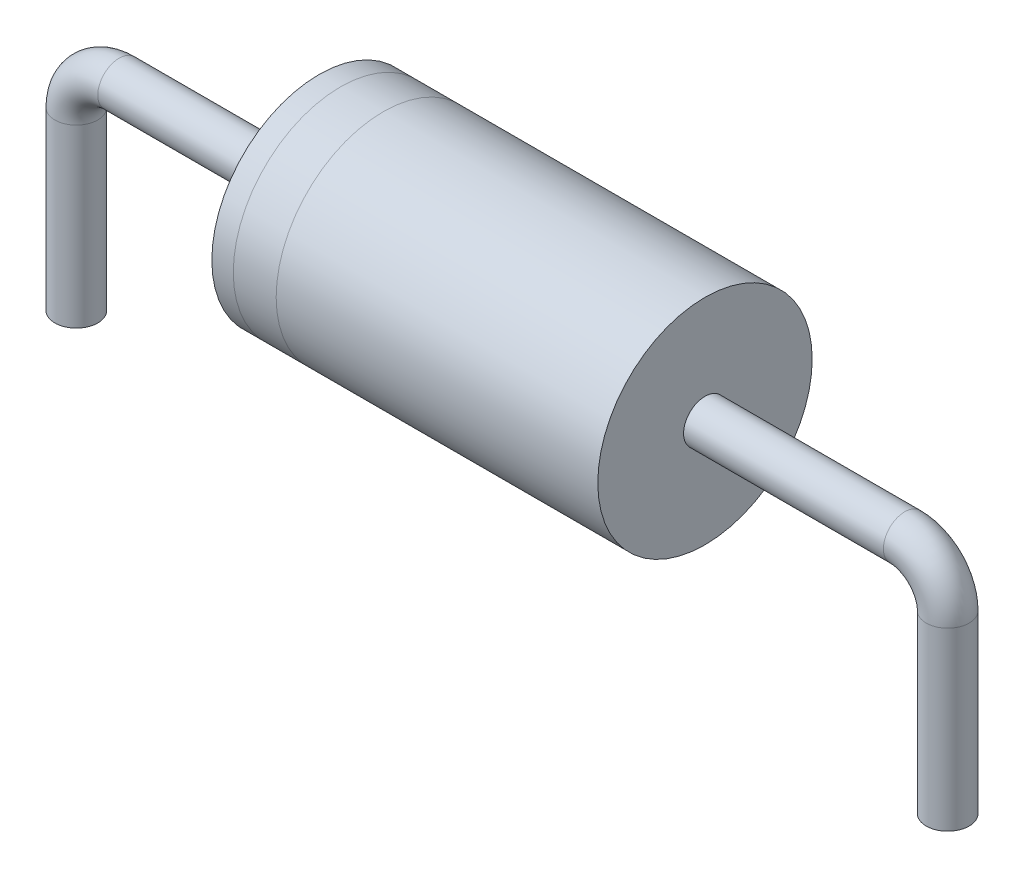
ISO-10303-21;
HEADER;
FILE_DESCRIPTION(('STEP AP214'),'2;1');
FILE_NAME('part.step','',(''),(''),'','','');
FILE_SCHEMA(('AUTOMOTIVE_DESIGN { 1 0 10303 214 1 1 1 1 }'));
ENDSEC;
DATA;
#1=APPLICATION_CONTEXT('core data for automotive mechanical design processes');
#2=APPLICATION_PROTOCOL_DEFINITION('international standard','automotive_design',2000,#1);
#3=PRODUCT_CONTEXT('',#1,'mechanical');
#4=PRODUCT('Part','Part','',(#3));
#5=PRODUCT_RELATED_PRODUCT_CATEGORY('part','',(#4));
#6=PRODUCT_DEFINITION_FORMATION('','',#4);
#7=PRODUCT_DEFINITION_CONTEXT('part definition',#1,'design');
#8=PRODUCT_DEFINITION('design','',#6,#7);
#9=PRODUCT_DEFINITION_SHAPE('','',#8);
#10=(LENGTH_UNIT() NAMED_UNIT(*) SI_UNIT(.MILLI.,.METRE.));
#11=(NAMED_UNIT(*) PLANE_ANGLE_UNIT() SI_UNIT($,.RADIAN.));
#12=(NAMED_UNIT(*) SI_UNIT($,.STERADIAN.) SOLID_ANGLE_UNIT());
#13=UNCERTAINTY_MEASURE_WITH_UNIT(LENGTH_MEASURE(1.E-05),#10,'distance_accuracy_value','');
#14=(GEOMETRIC_REPRESENTATION_CONTEXT(3) GLOBAL_UNCERTAINTY_ASSIGNED_CONTEXT((#13)) GLOBAL_UNIT_ASSIGNED_CONTEXT((#10,
#11,#12)) REPRESENTATION_CONTEXT('',''));
#15=CARTESIAN_POINT('',(0.,0.,0.));
#16=DIRECTION('',(0.,0.,1.));
#17=DIRECTION('',(1.,0.,0.));
#18=AXIS2_PLACEMENT_3D('',#15,#16,#17);
#19=CARTESIAN_POINT('',(-4.5,0.,0.));
#20=DIRECTION('',(1.,0.,0.));
#21=DIRECTION('',(0.,0.,-1.));
#22=AXIS2_PLACEMENT_3D('',#19,#20,#21);
#23=CYLINDRICAL_SURFACE('',#22,2.5);
#24=CARTESIAN_POINT('',(-3.,0.,0.));
#25=DIRECTION('',(1.,0.,0.));
#26=DIRECTION('',(0.,0.,-1.));
#27=AXIS2_PLACEMENT_3D('',#24,#25,#26);
#28=CIRCLE('',#27,2.5);
#29=CARTESIAN_POINT('',(-3.,0.,-2.5));
#30=VERTEX_POINT('',#29);
#31=EDGE_CURVE('E76',#30,#30,#28,.T.);
#32=ORIENTED_EDGE('',*,*,#31,.F.);
#33=EDGE_LOOP('',(#32));
#34=FACE_BOUND('',#33,.T.);
#35=CARTESIAN_POINT('',(-4.,0.,0.));
#36=DIRECTION('',(1.,0.,0.));
#37=DIRECTION('',(0.,0.,-1.));
#38=AXIS2_PLACEMENT_3D('',#35,#36,#37);
#39=CIRCLE('',#38,2.5);
#40=CARTESIAN_POINT('',(-4.,0.,-2.5));
#41=VERTEX_POINT('',#40);
#42=EDGE_CURVE('E13',#41,#41,#39,.T.);
#43=ORIENTED_EDGE('',*,*,#42,.T.);
#44=EDGE_LOOP('',(#43));
#45=FACE_BOUND('',#44,.T.);
#46=ADVANCED_FACE('F64',(#34,#45),#23,.T.);
#47=CARTESIAN_POINT('',(4.5,0.,0.));
#48=DIRECTION('',(1.,0.,0.));
#49=DIRECTION('',(0.,0.,-1.));
#50=AXIS2_PLACEMENT_3D('',#47,#48,#49);
#51=CIRCLE('',#50,2.5);
#52=CARTESIAN_POINT('',(4.5,0.,-2.5));
#53=VERTEX_POINT('',#52);
#54=EDGE_CURVE('E93',#53,#53,#51,.T.);
#55=ORIENTED_EDGE('',*,*,#54,.F.);
#56=EDGE_LOOP('',(#55));
#57=FACE_BOUND('',#56,.T.);
#58=ORIENTED_EDGE('',*,*,#31,.T.);
#59=EDGE_LOOP('',(#58));
#60=FACE_BOUND('',#59,.T.);
#61=ADVANCED_FACE('F144',(#57,#60),#23,.T.);
#62=ORIENTED_EDGE('',*,*,#42,.F.);
#63=EDGE_LOOP('',(#62));
#64=FACE_BOUND('',#63,.T.);
#65=CARTESIAN_POINT('',(-4.5,0.,0.));
#66=DIRECTION('',(1.,0.,0.));
#67=DIRECTION('',(0.,0.,-1.));
#68=AXIS2_PLACEMENT_3D('',#65,#66,#67);
#69=CIRCLE('',#68,2.5);
#70=CARTESIAN_POINT('',(-4.5,0.,-2.5));
#71=VERTEX_POINT('',#70);
#72=EDGE_CURVE('E103',#71,#71,#69,.T.);
#73=ORIENTED_EDGE('',*,*,#72,.T.);
#74=EDGE_LOOP('',(#73));
#75=FACE_BOUND('',#74,.T.);
#76=ADVANCED_FACE('F66',(#64,#75),#23,.T.);
#77=CARTESIAN_POINT('',(-4.5,0.,0.));
#78=DIRECTION('',(1.,0.,0.));
#79=DIRECTION('',(0.,0.,-1.));
#80=AXIS2_PLACEMENT_3D('',#77,#78,#79);
#81=PLANE('',#80);
#82=CARTESIAN_POINT('',(-4.5,0.,0.));
#83=DIRECTION('',(1.,0.,0.));
#84=DIRECTION('',(0.,0.,-1.));
#85=AXIS2_PLACEMENT_3D('',#82,#83,#84);
#86=CIRCLE('',#85,0.5);
#87=CARTESIAN_POINT('',(-4.5,0.,-0.5));
#88=VERTEX_POINT('',#87);
#89=EDGE_CURVE('E100',#88,#88,#86,.F.);
#90=ORIENTED_EDGE('',*,*,#89,.F.);
#91=EDGE_LOOP('',(#90));
#92=FACE_BOUND('',#91,.T.);
#93=ORIENTED_EDGE('',*,*,#72,.F.);
#94=EDGE_LOOP('',(#93));
#95=FACE_BOUND('',#94,.T.);
#96=ADVANCED_FACE('F143',(#92,#95),#81,.F.);
#97=CARTESIAN_POINT('',(4.5,0.,0.));
#98=DIRECTION('',(1.,0.,0.));
#99=DIRECTION('',(0.,0.,-1.));
#100=AXIS2_PLACEMENT_3D('',#97,#98,#99);
#101=PLANE('',#100);
#102=CARTESIAN_POINT('',(4.5,0.,0.));
#103=DIRECTION('',(1.,0.,0.));
#104=DIRECTION('',(0.,0.,-1.));
#105=AXIS2_PLACEMENT_3D('',#102,#103,#104);
#106=CIRCLE('',#105,0.5);
#107=CARTESIAN_POINT('',(4.5,0.,-0.5));
#108=VERTEX_POINT('',#107);
#109=EDGE_CURVE('E89',#108,#108,#106,.F.);
#110=ORIENTED_EDGE('',*,*,#109,.T.);
#111=EDGE_LOOP('',(#110));
#112=FACE_BOUND('',#111,.T.);
#113=ORIENTED_EDGE('',*,*,#54,.T.);
#114=EDGE_LOOP('',(#113));
#115=FACE_BOUND('',#114,.T.);
#116=ADVANCED_FACE('F148',(#112,#115),#101,.T.);
#117=CARTESIAN_POINT('',(10.16,-5.1,0.));
#118=DIRECTION('',(0.,-1.,0.));
#119=DIRECTION('',(0.,0.,-1.));
#120=AXIS2_PLACEMENT_3D('',#117,#118,#119);
#121=PLANE('',#120);
#122=CARTESIAN_POINT('',(10.16,-5.1,0.));
#123=DIRECTION('',(0.,-1.,0.));
#124=DIRECTION('',(0.,0.,-1.));
#125=AXIS2_PLACEMENT_3D('',#122,#123,#124);
#126=CIRCLE('',#125,0.5);
#127=CARTESIAN_POINT('',(10.16,-5.1,-0.5));
#128=VERTEX_POINT('',#127);
#129=EDGE_CURVE('E81',#128,#128,#126,.T.);
#130=ORIENTED_EDGE('',*,*,#129,.T.);
#131=EDGE_LOOP('',(#130));
#132=FACE_BOUND('',#131,.T.);
#133=ADVANCED_FACE('F153',(#132),#121,.T.);
#134=CARTESIAN_POINT('',(10.16,-5.1,0.));
#135=DIRECTION('',(0.,1.,0.));
#136=DIRECTION('',(0.,0.,1.));
#137=AXIS2_PLACEMENT_3D('',#134,#135,#136);
#138=CYLINDRICAL_SURFACE('',#137,0.5);
#139=CARTESIAN_POINT('',(10.16,-0.999999999999999,0.));
#140=DIRECTION('',(0.,-1.,0.));
#141=DIRECTION('',(0.,0.,-1.));
#142=AXIS2_PLACEMENT_3D('',#139,#140,#141);
#143=CIRCLE('',#142,0.5);
#144=CARTESIAN_POINT('',(10.66,-0.999999999999999,0.));
#145=VERTEX_POINT('',#144);
#146=EDGE_CURVE('E273',#145,#145,#143,.T.);
#147=ORIENTED_EDGE('',*,*,#146,.T.);
#148=EDGE_LOOP('',(#147));
#149=FACE_BOUND('',#148,.T.);
#150=ORIENTED_EDGE('',*,*,#129,.F.);
#151=EDGE_LOOP('',(#150));
#152=FACE_BOUND('',#151,.T.);
#153=ADVANCED_FACE('F190',(#149,#152),#138,.T.);
#154=CARTESIAN_POINT('',(9.16,-1.,0.));
#155=DIRECTION('',(0.,0.,1.));
#156=DIRECTION('',(1.,0.,0.));
#157=AXIS2_PLACEMENT_3D('',#154,#155,#156);
#158=TOROIDAL_SURFACE('',#157,0.999999999999999,0.5);
#159=CARTESIAN_POINT('',(9.16,0.,0.));
#160=DIRECTION('',(1.,0.,0.));
#161=DIRECTION('',(0.,0.,-1.));
#162=AXIS2_PLACEMENT_3D('',#159,#160,#161);
#163=CIRCLE('',#162,0.5);
#164=CARTESIAN_POINT('',(9.16,0.499999999999999,0.));
#165=VERTEX_POINT('',#164);
#166=EDGE_CURVE('E271',#165,#165,#163,.T.);
#167=CARTESIAN_POINT('',(9.16,-1.,0.));
#168=DIRECTION('',(0.,0.,1.));
#169=DIRECTION('',(1.,0.,0.));
#170=AXIS2_PLACEMENT_3D('',#167,#168,#169);
#171=CIRCLE('',#170,1.5);
#172=EDGE_CURVE('',#145,#165,#171,.T.);
#173=ORIENTED_EDGE('',*,*,#146,.F.);
#174=ORIENTED_EDGE('',*,*,#166,.T.);
#175=ORIENTED_EDGE('',*,*,#172,.T.);
#176=ORIENTED_EDGE('',*,*,#172,.F.);
#177=EDGE_LOOP('',(#173,#175,#174,#176));
#178=FACE_BOUND('',#177,.T.);
#179=ADVANCED_FACE('F199',(#178),#158,.T.);
#180=CARTESIAN_POINT('',(9.16,0.,0.));
#181=DIRECTION('',(-1.,0.,0.));
#182=DIRECTION('',(0.,0.,1.));
#183=AXIS2_PLACEMENT_3D('',#180,#181,#182);
#184=CYLINDRICAL_SURFACE('',#183,0.5);
#185=ORIENTED_EDGE('',*,*,#109,.F.);
#186=EDGE_LOOP('',(#185));
#187=FACE_BOUND('',#186,.T.);
#188=ORIENTED_EDGE('',*,*,#166,.F.);
#189=EDGE_LOOP('',(#188));
#190=FACE_BOUND('',#189,.T.);
#191=ADVANCED_FACE('F208',(#187,#190),#184,.T.);
#192=CARTESIAN_POINT('',(-9.16,0.,0.));
#193=DIRECTION('',(1.,0.,0.));
#194=DIRECTION('',(0.,0.,-1.));
#195=AXIS2_PLACEMENT_3D('',#192,#193,#194);
#196=CIRCLE('',#195,0.5);
#197=CARTESIAN_POINT('',(-9.16,0.5,0.));
#198=VERTEX_POINT('',#197);
#199=EDGE_CURVE('E96',#198,#198,#196,.T.);
#200=ORIENTED_EDGE('',*,*,#199,.T.);
#201=EDGE_LOOP('',(#200));
#202=FACE_BOUND('',#201,.T.);
#203=ORIENTED_EDGE('',*,*,#89,.T.);
#204=EDGE_LOOP('',(#203));
#205=FACE_BOUND('',#204,.T.);
#206=ADVANCED_FACE('F217',(#202,#205),#184,.T.);
#207=CARTESIAN_POINT('',(-10.16,-5.1,0.));
#208=DIRECTION('',(0.,1.,0.));
#209=DIRECTION('',(0.,0.,-1.));
#210=AXIS2_PLACEMENT_3D('',#207,#208,#209);
#211=PLANE('',#210);
#212=CARTESIAN_POINT('',(-10.16,-5.1,0.));
#213=DIRECTION('',(0.,1.,0.));
#214=DIRECTION('',(0.,0.,-1.));
#215=AXIS2_PLACEMENT_3D('',#212,#213,#214);
#216=CIRCLE('',#215,0.5);
#217=CARTESIAN_POINT('',(-10.16,-5.1,-0.5));
#218=VERTEX_POINT('',#217);
#219=EDGE_CURVE('E85',#218,#218,#216,.T.);
#220=ORIENTED_EDGE('',*,*,#219,.F.);
#221=EDGE_LOOP('',(#220));
#222=FACE_BOUND('',#221,.T.);
#223=ADVANCED_FACE('F226',(#222),#211,.F.);
#224=CARTESIAN_POINT('',(-9.16,-1.,0.));
#225=DIRECTION('',(0.,0.,1.));
#226=DIRECTION('',(1.,0.,0.));
#227=AXIS2_PLACEMENT_3D('',#224,#225,#226);
#228=TOROIDAL_SURFACE('',#227,1.,0.5);
#229=CARTESIAN_POINT('',(-10.16,-1.,0.));
#230=DIRECTION('',(0.,1.,0.));
#231=DIRECTION('',(0.,0.,-1.));
#232=AXIS2_PLACEMENT_3D('',#229,#230,#231);
#233=CIRCLE('',#232,0.5);
#234=CARTESIAN_POINT('',(-10.66,-1.,0.));
#235=VERTEX_POINT('',#234);
#236=EDGE_CURVE('E90',#235,#235,#233,.T.);
#237=CARTESIAN_POINT('',(-9.16,-1.,0.));
#238=DIRECTION('',(0.,0.,1.));
#239=DIRECTION('',(1.,0.,0.));
#240=AXIS2_PLACEMENT_3D('',#237,#238,#239);
#241=CIRCLE('',#240,1.5);
#242=EDGE_CURVE('',#198,#235,#241,.T.);
#243=ORIENTED_EDGE('',*,*,#199,.F.);
#244=ORIENTED_EDGE('',*,*,#236,.T.);
#245=ORIENTED_EDGE('',*,*,#242,.T.);
#246=ORIENTED_EDGE('',*,*,#242,.F.);
#247=EDGE_LOOP('',(#243,#245,#244,#246));
#248=FACE_BOUND('',#247,.T.);
#249=ADVANCED_FACE('F234',(#248),#228,.T.);
#250=CARTESIAN_POINT('',(-10.16,-1.,0.));
#251=DIRECTION('',(0.,-1.,0.));
#252=DIRECTION('',(0.,0.,-1.));
#253=AXIS2_PLACEMENT_3D('',#250,#251,#252);
#254=CYLINDRICAL_SURFACE('',#253,0.5);
#255=ORIENTED_EDGE('',*,*,#219,.T.);
#256=EDGE_LOOP('',(#255));
#257=FACE_BOUND('',#256,.T.);
#258=ORIENTED_EDGE('',*,*,#236,.F.);
#259=EDGE_LOOP('',(#258));
#260=FACE_BOUND('',#259,.T.);
#261=ADVANCED_FACE('F86',(#257,#260),#254,.T.);
#262=CLOSED_SHELL('',(#46,#61,#76,#96,#116,#133,#153,#179,#191,#206,#223,#249,#261));
#263=MANIFOLD_SOLID_BREP('B2',#262);
#264=ADVANCED_BREP_SHAPE_REPRESENTATION('',(#18,#263),#14);
#265=SHAPE_DEFINITION_REPRESENTATION(#9,#264);
ENDSEC;
END-ISO-10303-21;
